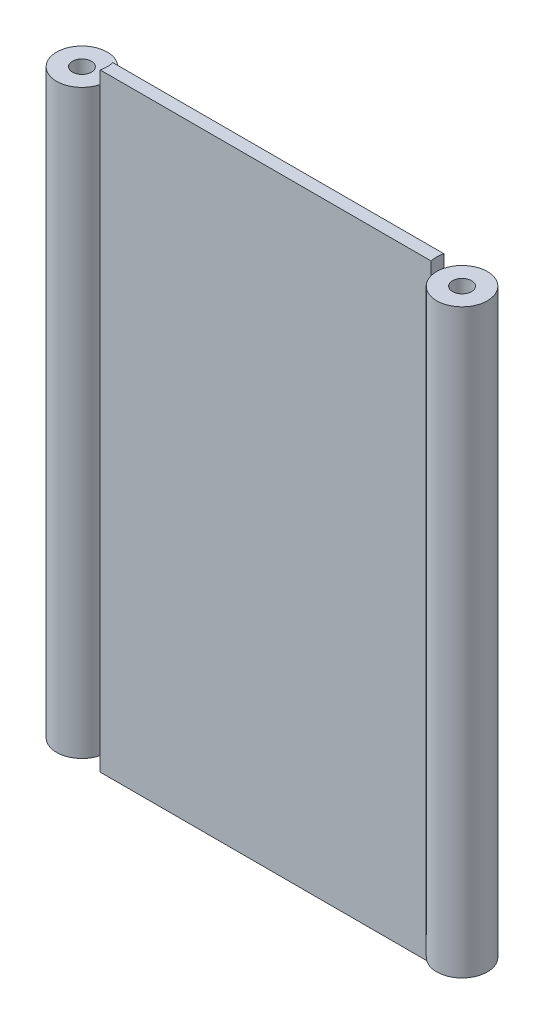
ISO-10303-21;
HEADER;
FILE_DESCRIPTION(('STEP AP214'),'2;1');
FILE_NAME('part.step','',(''),(''),'','','');
FILE_SCHEMA(('AUTOMOTIVE_DESIGN { 1 0 10303 214 1 1 1 1 }'));
ENDSEC;
DATA;
#1=APPLICATION_CONTEXT('core data for automotive mechanical design processes');
#2=APPLICATION_PROTOCOL_DEFINITION('international standard','automotive_design',2000,#1);
#3=PRODUCT_CONTEXT('',#1,'mechanical');
#4=PRODUCT('Part','Part','',(#3));
#5=PRODUCT_RELATED_PRODUCT_CATEGORY('part','',(#4));
#6=PRODUCT_DEFINITION_FORMATION('','',#4);
#7=PRODUCT_DEFINITION_CONTEXT('part definition',#1,'design');
#8=PRODUCT_DEFINITION('design','',#6,#7);
#9=PRODUCT_DEFINITION_SHAPE('','',#8);
#10=(LENGTH_UNIT() NAMED_UNIT(*) SI_UNIT(.MILLI.,.METRE.));
#11=(NAMED_UNIT(*) PLANE_ANGLE_UNIT() SI_UNIT($,.RADIAN.));
#12=(NAMED_UNIT(*) SI_UNIT($,.STERADIAN.) SOLID_ANGLE_UNIT());
#13=UNCERTAINTY_MEASURE_WITH_UNIT(LENGTH_MEASURE(1.E-05),#10,'distance_accuracy_value','');
#14=(GEOMETRIC_REPRESENTATION_CONTEXT(3) GLOBAL_UNCERTAINTY_ASSIGNED_CONTEXT((#13)) GLOBAL_UNIT_ASSIGNED_CONTEXT((#10,
#11,#12)) REPRESENTATION_CONTEXT('',''));
#15=CARTESIAN_POINT('',(0.,0.,0.));
#16=DIRECTION('',(0.,0.,1.));
#17=DIRECTION('',(1.,0.,0.));
#18=AXIS2_PLACEMENT_3D('',#15,#16,#17);
#19=CARTESIAN_POINT('',(47.625,152.4,-1.5875));
#20=DIRECTION('',(0.,-1.,0.));
#21=DIRECTION('',(0.,0.,-1.));
#22=AXIS2_PLACEMENT_3D('',#19,#20,#21);
#23=CYLINDRICAL_SURFACE('',#22,6.35);
#24=DIRECTION('',(0.,-1.,0.));
#25=VECTOR('',#24,1.);
#26=CARTESIAN_POINT('',(41.4766389378957,152.4,-3.175));
#27=LINE('',#26,#25);
#28=CARTESIAN_POINT('',(41.4766389378957,149.225,-3.175));
#29=VERTEX_POINT('',#28);
#30=CARTESIAN_POINT('',(41.4766389378957,3.57187500000006,-3.175));
#31=VERTEX_POINT('',#30);
#32=EDGE_CURVE('E93',#29,#31,#27,.T.);
#33=ORIENTED_EDGE('',*,*,#32,.F.);
#34=CARTESIAN_POINT('',(47.625,149.225,-1.5875));
#35=DIRECTION('',(0.,-1.,0.));
#36=DIRECTION('',(0.,0.,1.));
#37=AXIS2_PLACEMENT_3D('',#34,#35,#36);
#38=CIRCLE('',#37,6.35);
#39=CARTESIAN_POINT('',(41.4766389378957,149.225,0.));
#40=VERTEX_POINT('',#39);
#41=EDGE_CURVE('E144',#29,#40,#38,.T.);
#42=ORIENTED_EDGE('',*,*,#41,.T.);
#43=DIRECTION('',(0.,-1.,0.));
#44=VECTOR('',#43,1.);
#45=CARTESIAN_POINT('',(41.4766389378957,152.4,0.));
#46=LINE('',#45,#44);
#47=CARTESIAN_POINT('',(41.4766389378957,3.571875,0.));
#48=VERTEX_POINT('',#47);
#49=EDGE_CURVE('E159',#40,#48,#46,.T.);
#50=ORIENTED_EDGE('',*,*,#49,.T.);
#51=CARTESIAN_POINT('',(47.625,3.571875,-1.5875));
#52=DIRECTION('',(0.,1.,0.));
#53=DIRECTION('',(0.,0.,-1.));
#54=AXIS2_PLACEMENT_3D('',#51,#52,#53);
#55=CIRCLE('',#54,6.35);
#56=EDGE_CURVE('E172',#48,#31,#55,.T.);
#57=ORIENTED_EDGE('',*,*,#56,.T.);
#58=EDGE_LOOP('',(#33,#42,#50,#57));
#59=FACE_BOUND('',#58,.T.);
#60=ADVANCED_FACE('F68',(#59),#23,.T.);
#61=CARTESIAN_POINT('',(47.625,152.4,-1.5875));
#62=DIRECTION('',(0.,-1.,0.));
#63=DIRECTION('',(0.,0.,-1.));
#64=AXIS2_PLACEMENT_3D('',#61,#62,#63);
#65=CYLINDRICAL_SURFACE('',#64,2.38125);
#66=CARTESIAN_POINT('',(47.625,3.571875,-1.5875));
#67=DIRECTION('',(0.,-1.,0.));
#68=DIRECTION('',(0.,0.,-1.));
#69=AXIS2_PLACEMENT_3D('',#66,#67,#68);
#70=CIRCLE('',#69,2.38125);
#71=CARTESIAN_POINT('',(47.625,3.571875,-3.96875));
#72=VERTEX_POINT('',#71);
#73=EDGE_CURVE('E72',#72,#72,#70,.F.);
#74=ORIENTED_EDGE('',*,*,#73,.F.);
#75=EDGE_LOOP('',(#74));
#76=FACE_BOUND('',#75,.T.);
#77=CARTESIAN_POINT('',(47.625,149.225,-1.5875));
#78=DIRECTION('',(0.,1.,0.));
#79=DIRECTION('',(0.,0.,1.));
#80=AXIS2_PLACEMENT_3D('',#77,#78,#79);
#81=CIRCLE('',#80,2.38125);
#82=CARTESIAN_POINT('',(47.625,149.225,0.793749999999999));
#83=VERTEX_POINT('',#82);
#84=EDGE_CURVE('E178',#83,#83,#81,.F.);
#85=ORIENTED_EDGE('',*,*,#84,.F.);
#86=EDGE_LOOP('',(#85));
#87=FACE_BOUND('',#86,.T.);
#88=ADVANCED_FACE('F199',(#76,#87),#65,.F.);
#89=CARTESIAN_POINT('',(-47.625,152.4,-1.5875));
#90=DIRECTION('',(0.,1.,0.));
#91=DIRECTION('',(0.,0.,1.));
#92=AXIS2_PLACEMENT_3D('',#89,#90,#91);
#93=PLANE('',#92);
#94=DIRECTION('',(1.,0.,0.));
#95=VECTOR('',#94,1.);
#96=CARTESIAN_POINT('',(-41.4766389378957,152.4,0.));
#97=LINE('',#96,#95);
#98=CARTESIAN_POINT('',(-41.4766389378957,152.4,0.));
#99=VERTEX_POINT('',#98);
#100=CARTESIAN_POINT('',(41.4766389378957,152.4,0.));
#101=VERTEX_POINT('',#100);
#102=EDGE_CURVE('E148',#99,#101,#97,.T.);
#103=ORIENTED_EDGE('',*,*,#102,.T.);
#104=CARTESIAN_POINT('',(47.625,152.4,-1.5875));
#105=DIRECTION('',(0.,-1.,0.));
#106=DIRECTION('',(0.,0.,1.));
#107=AXIS2_PLACEMENT_3D('',#104,#105,#106);
#108=CIRCLE('',#107,6.35);
#109=CARTESIAN_POINT('',(41.4766389378957,152.4,-3.175));
#110=VERTEX_POINT('',#109);
#111=EDGE_CURVE('E135',#101,#110,#108,.T.);
#112=ORIENTED_EDGE('',*,*,#111,.T.);
#113=DIRECTION('',(1.,0.,0.));
#114=VECTOR('',#113,1.);
#115=CARTESIAN_POINT('',(-41.4766389378957,152.4,-3.175));
#116=LINE('',#115,#114);
#117=CARTESIAN_POINT('',(-41.4766389378957,152.4,-3.175));
#118=VERTEX_POINT('',#117);
#119=EDGE_CURVE('E152',#118,#110,#116,.T.);
#120=ORIENTED_EDGE('',*,*,#119,.F.);
#121=CARTESIAN_POINT('',(-47.625,152.4,-1.5875));
#122=DIRECTION('',(0.,1.,0.));
#123=DIRECTION('',(0.,0.,1.));
#124=AXIS2_PLACEMENT_3D('',#121,#122,#123);
#125=CIRCLE('',#124,6.35);
#126=EDGE_CURVE('E150',#99,#118,#125,.T.);
#127=ORIENTED_EDGE('',*,*,#126,.F.);
#128=EDGE_LOOP('',(#103,#112,#120,#127));
#129=FACE_BOUND('',#128,.T.);
#130=ADVANCED_FACE('F149',(#129),#93,.T.);
#131=CARTESIAN_POINT('',(-47.625,0.,-1.5875));
#132=DIRECTION('',(0.,1.,0.));
#133=DIRECTION('',(0.,0.,1.));
#134=AXIS2_PLACEMENT_3D('',#131,#132,#133);
#135=PLANE('',#134);
#136=CARTESIAN_POINT('',(47.625,0.,-1.5875));
#137=DIRECTION('',(0.,1.,0.));
#138=DIRECTION('',(0.,0.,-1.));
#139=AXIS2_PLACEMENT_3D('',#136,#137,#138);
#140=CIRCLE('',#139,6.35);
#141=CARTESIAN_POINT('',(41.4766389378957,0.,-3.175));
#142=VERTEX_POINT('',#141);
#143=CARTESIAN_POINT('',(41.4766389378957,0.,0.));
#144=VERTEX_POINT('',#143);
#145=EDGE_CURVE('E176',#142,#144,#140,.T.);
#146=ORIENTED_EDGE('',*,*,#145,.T.);
#147=DIRECTION('',(1.,0.,0.));
#148=VECTOR('',#147,1.);
#149=CARTESIAN_POINT('',(-41.4766389378957,0.,0.));
#150=LINE('',#149,#148);
#151=CARTESIAN_POINT('',(-41.4766389378957,0.,0.));
#152=VERTEX_POINT('',#151);
#153=EDGE_CURVE('E368',#152,#144,#150,.T.);
#154=ORIENTED_EDGE('',*,*,#153,.F.);
#155=CARTESIAN_POINT('',(-47.625,0.,-1.5875));
#156=DIRECTION('',(0.,-1.,0.));
#157=DIRECTION('',(0.,0.,-1.));
#158=AXIS2_PLACEMENT_3D('',#155,#156,#157);
#159=CIRCLE('',#158,6.35);
#160=CARTESIAN_POINT('',(-41.4766389378957,0.,-3.175));
#161=VERTEX_POINT('',#160);
#162=EDGE_CURVE('E375',#161,#152,#159,.T.);
#163=ORIENTED_EDGE('',*,*,#162,.F.);
#164=DIRECTION('',(1.,0.,0.));
#165=VECTOR('',#164,1.);
#166=CARTESIAN_POINT('',(-41.4766389378957,0.,-3.175));
#167=LINE('',#166,#165);
#168=EDGE_CURVE('E153',#161,#142,#167,.T.);
#169=ORIENTED_EDGE('',*,*,#168,.T.);
#170=EDGE_LOOP('',(#146,#154,#163,#169));
#171=FACE_BOUND('',#170,.T.);
#172=ADVANCED_FACE('F232',(#171),#135,.F.);
#173=CARTESIAN_POINT('',(-47.625,152.4,-1.5875));
#174=DIRECTION('',(0.,-1.,0.));
#175=DIRECTION('',(0.,0.,-1.));
#176=AXIS2_PLACEMENT_3D('',#173,#174,#175);
#177=CYLINDRICAL_SURFACE('',#176,6.35);
#178=CARTESIAN_POINT('',(-47.625,149.225,-1.5875));
#179=DIRECTION('',(0.,1.,0.));
#180=DIRECTION('',(0.,0.,1.));
#181=AXIS2_PLACEMENT_3D('',#178,#179,#180);
#182=CIRCLE('',#181,6.35);
#183=CARTESIAN_POINT('',(-41.4766389378957,149.225,-3.175));
#184=VERTEX_POINT('',#183);
#185=CARTESIAN_POINT('',(-41.4766389378957,149.225,0.));
#186=VERTEX_POINT('',#185);
#187=EDGE_CURVE('E344',#184,#186,#182,.T.);
#188=ORIENTED_EDGE('',*,*,#187,.F.);
#189=DIRECTION('',(0.,-1.,0.));
#190=VECTOR('',#189,1.);
#191=CARTESIAN_POINT('',(-41.4766389378957,152.4,-3.175));
#192=LINE('',#191,#190);
#193=CARTESIAN_POINT('',(-41.4766389378957,3.57187500000006,-3.175));
#194=VERTEX_POINT('',#193);
#195=EDGE_CURVE('E347',#184,#194,#192,.T.);
#196=ORIENTED_EDGE('',*,*,#195,.T.);
#197=CARTESIAN_POINT('',(-47.625,3.571875,-1.5875));
#198=DIRECTION('',(0.,-1.,0.));
#199=DIRECTION('',(0.,0.,-1.));
#200=AXIS2_PLACEMENT_3D('',#197,#198,#199);
#201=CIRCLE('',#200,6.35);
#202=CARTESIAN_POINT('',(-41.4766389378957,3.571875,0.));
#203=VERTEX_POINT('',#202);
#204=EDGE_CURVE('E371',#203,#194,#201,.T.);
#205=ORIENTED_EDGE('',*,*,#204,.F.);
#206=DIRECTION('',(0.,-1.,0.));
#207=VECTOR('',#206,1.);
#208=CARTESIAN_POINT('',(-41.4766389378957,152.4,0.));
#209=LINE('',#208,#207);
#210=EDGE_CURVE('E77',#186,#203,#209,.T.);
#211=ORIENTED_EDGE('',*,*,#210,.F.);
#212=EDGE_LOOP('',(#188,#196,#205,#211));
#213=FACE_BOUND('',#212,.T.);
#214=ADVANCED_FACE('F70',(#213),#177,.T.);
#215=CARTESIAN_POINT('',(-47.625,152.4,-1.5875));
#216=DIRECTION('',(0.,-1.,0.));
#217=DIRECTION('',(0.,0.,-1.));
#218=AXIS2_PLACEMENT_3D('',#215,#216,#217);
#219=CYLINDRICAL_SURFACE('',#218,2.38125);
#220=CARTESIAN_POINT('',(-47.625,3.571875,-1.5875));
#221=DIRECTION('',(0.,-1.,0.));
#222=DIRECTION('',(0.,0.,-1.));
#223=AXIS2_PLACEMENT_3D('',#220,#221,#222);
#224=CIRCLE('',#223,2.38125);
#225=CARTESIAN_POINT('',(-47.625,3.571875,-3.96875));
#226=VERTEX_POINT('',#225);
#227=EDGE_CURVE('E362',#226,#226,#224,.T.);
#228=ORIENTED_EDGE('',*,*,#227,.T.);
#229=EDGE_LOOP('',(#228));
#230=FACE_BOUND('',#229,.T.);
#231=CARTESIAN_POINT('',(-47.625,149.225,-1.5875));
#232=DIRECTION('',(0.,1.,0.));
#233=DIRECTION('',(0.,0.,1.));
#234=AXIS2_PLACEMENT_3D('',#231,#232,#233);
#235=CIRCLE('',#234,2.38125);
#236=CARTESIAN_POINT('',(-47.625,149.225,0.793749999999999));
#237=VERTEX_POINT('',#236);
#238=EDGE_CURVE('E378',#237,#237,#235,.T.);
#239=ORIENTED_EDGE('',*,*,#238,.T.);
#240=EDGE_LOOP('',(#239));
#241=FACE_BOUND('',#240,.T.);
#242=ADVANCED_FACE('F226',(#230,#241),#219,.F.);
#243=CARTESIAN_POINT('',(-41.4766389378957,152.4,0.));
#244=DIRECTION('',(0.,0.,-1.));
#245=DIRECTION('',(-1.,0.,0.));
#246=AXIS2_PLACEMENT_3D('',#243,#244,#245);
#247=PLANE('',#246);
#248=ORIENTED_EDGE('',*,*,#153,.T.);
#249=EDGE_CURVE('E162',#48,#144,#46,.T.);
#250=ORIENTED_EDGE('',*,*,#249,.F.);
#251=ORIENTED_EDGE('',*,*,#49,.F.);
#252=EDGE_CURVE('E139',#101,#40,#46,.T.);
#253=ORIENTED_EDGE('',*,*,#252,.F.);
#254=ORIENTED_EDGE('',*,*,#102,.F.);
#255=EDGE_CURVE('E12',#99,#186,#209,.T.);
#256=ORIENTED_EDGE('',*,*,#255,.T.);
#257=ORIENTED_EDGE('',*,*,#210,.T.);
#258=DIRECTION('',(0.,-1.,0.));
#259=VECTOR('',#258,1.);
#260=CARTESIAN_POINT('',(-41.4766389378957,3.571875,0.));
#261=LINE('',#260,#259);
#262=EDGE_CURVE('E364',#203,#152,#261,.T.);
#263=ORIENTED_EDGE('',*,*,#262,.T.);
#264=EDGE_LOOP('',(#248,#250,#251,#253,#254,#256,#257,#263));
#265=FACE_BOUND('',#264,.T.);
#266=ADVANCED_FACE('F157',(#265),#247,.F.);
#267=CARTESIAN_POINT('',(-41.4766389378957,152.4,-3.175));
#268=DIRECTION('',(0.,0.,-1.));
#269=DIRECTION('',(-1.,0.,0.));
#270=AXIS2_PLACEMENT_3D('',#267,#268,#269);
#271=PLANE('',#270);
#272=ORIENTED_EDGE('',*,*,#168,.F.);
#273=EDGE_CURVE('E358',#194,#161,#192,.T.);
#274=ORIENTED_EDGE('',*,*,#273,.F.);
#275=ORIENTED_EDGE('',*,*,#195,.F.);
#276=EDGE_CURVE('E357',#118,#184,#192,.T.);
#277=ORIENTED_EDGE('',*,*,#276,.F.);
#278=ORIENTED_EDGE('',*,*,#119,.T.);
#279=EDGE_CURVE('E140',#110,#29,#27,.T.);
#280=ORIENTED_EDGE('',*,*,#279,.T.);
#281=ORIENTED_EDGE('',*,*,#32,.T.);
#282=EDGE_CURVE('E160',#31,#142,#27,.T.);
#283=ORIENTED_EDGE('',*,*,#282,.T.);
#284=EDGE_LOOP('',(#272,#274,#275,#277,#278,#280,#281,#283));
#285=FACE_BOUND('',#284,.T.);
#286=ADVANCED_FACE('F224',(#285),#271,.T.);
#287=CARTESIAN_POINT('',(-47.625,3.571875,-1.5875));
#288=DIRECTION('',(0.,-1.,0.));
#289=DIRECTION('',(0.,0.,-1.));
#290=AXIS2_PLACEMENT_3D('',#287,#288,#289);
#291=CYLINDRICAL_SURFACE('',#290,6.35);
#292=EDGE_CURVE('E365',#194,#203,#201,.T.);
#293=ORIENTED_EDGE('',*,*,#292,.F.);
#294=ORIENTED_EDGE('',*,*,#273,.T.);
#295=ORIENTED_EDGE('',*,*,#162,.T.);
#296=ORIENTED_EDGE('',*,*,#262,.F.);
#297=EDGE_LOOP('',(#293,#294,#295,#296));
#298=FACE_BOUND('',#297,.T.);
#299=ADVANCED_FACE('F220',(#298),#291,.F.);
#300=CARTESIAN_POINT('',(-47.625,3.571875,-1.5875));
#301=DIRECTION('',(0.,-1.,0.));
#302=DIRECTION('',(0.,0.,-1.));
#303=AXIS2_PLACEMENT_3D('',#300,#301,#302);
#304=PLANE('',#303);
#305=ORIENTED_EDGE('',*,*,#227,.F.);
#306=EDGE_LOOP('',(#305));
#307=FACE_BOUND('',#306,.T.);
#308=ORIENTED_EDGE('',*,*,#292,.T.);
#309=ORIENTED_EDGE('',*,*,#204,.T.);
#310=EDGE_LOOP('',(#308,#309));
#311=FACE_BOUND('',#310,.T.);
#312=ADVANCED_FACE('F216',(#307,#311),#304,.T.);
#313=CARTESIAN_POINT('',(-47.625,149.225,-1.5875));
#314=DIRECTION('',(0.,1.,0.));
#315=DIRECTION('',(0.,0.,1.));
#316=AXIS2_PLACEMENT_3D('',#313,#314,#315);
#317=CYLINDRICAL_SURFACE('',#316,6.35);
#318=ORIENTED_EDGE('',*,*,#126,.T.);
#319=ORIENTED_EDGE('',*,*,#276,.T.);
#320=EDGE_CURVE('E352',#186,#184,#182,.T.);
#321=ORIENTED_EDGE('',*,*,#320,.F.);
#322=ORIENTED_EDGE('',*,*,#255,.F.);
#323=EDGE_LOOP('',(#318,#319,#321,#322));
#324=FACE_BOUND('',#323,.T.);
#325=ADVANCED_FACE('F212',(#324),#317,.F.);
#326=CARTESIAN_POINT('',(-47.625,149.225,-1.5875));
#327=DIRECTION('',(0.,1.,0.));
#328=DIRECTION('',(0.,0.,1.));
#329=AXIS2_PLACEMENT_3D('',#326,#327,#328);
#330=PLANE('',#329);
#331=ORIENTED_EDGE('',*,*,#238,.F.);
#332=EDGE_LOOP('',(#331));
#333=FACE_BOUND('',#332,.T.);
#334=ORIENTED_EDGE('',*,*,#320,.T.);
#335=ORIENTED_EDGE('',*,*,#187,.T.);
#336=EDGE_LOOP('',(#334,#335));
#337=FACE_BOUND('',#336,.T.);
#338=ADVANCED_FACE('F208',(#333,#337),#330,.T.);
#339=CARTESIAN_POINT('',(47.625,3.571875,-1.5875));
#340=DIRECTION('',(0.,-1.,0.));
#341=DIRECTION('',(0.,0.,-1.));
#342=AXIS2_PLACEMENT_3D('',#339,#340,#341);
#343=CYLINDRICAL_SURFACE('',#342,6.35);
#344=ORIENTED_EDGE('',*,*,#249,.T.);
#345=ORIENTED_EDGE('',*,*,#145,.F.);
#346=ORIENTED_EDGE('',*,*,#282,.F.);
#347=EDGE_CURVE('E169',#31,#48,#55,.T.);
#348=ORIENTED_EDGE('',*,*,#347,.T.);
#349=EDGE_LOOP('',(#344,#345,#346,#348));
#350=FACE_BOUND('',#349,.T.);
#351=ADVANCED_FACE('F211',(#350),#343,.F.);
#352=CARTESIAN_POINT('',(47.625,3.571875,-1.5875));
#353=DIRECTION('',(0.,-1.,0.));
#354=DIRECTION('',(0.,0.,-1.));
#355=AXIS2_PLACEMENT_3D('',#352,#353,#354);
#356=PLANE('',#355);
#357=ORIENTED_EDGE('',*,*,#347,.F.);
#358=ORIENTED_EDGE('',*,*,#56,.F.);
#359=EDGE_LOOP('',(#357,#358));
#360=FACE_BOUND('',#359,.T.);
#361=ORIENTED_EDGE('',*,*,#73,.T.);
#362=EDGE_LOOP('',(#361));
#363=FACE_BOUND('',#362,.T.);
#364=ADVANCED_FACE('F196',(#360,#363),#356,.T.);
#365=CARTESIAN_POINT('',(47.625,149.225,-1.5875));
#366=DIRECTION('',(0.,1.,0.));
#367=DIRECTION('',(0.,0.,1.));
#368=AXIS2_PLACEMENT_3D('',#365,#366,#367);
#369=CYLINDRICAL_SURFACE('',#368,6.35);
#370=ORIENTED_EDGE('',*,*,#252,.T.);
#371=EDGE_CURVE('E85',#40,#29,#38,.T.);
#372=ORIENTED_EDGE('',*,*,#371,.T.);
#373=ORIENTED_EDGE('',*,*,#279,.F.);
#374=ORIENTED_EDGE('',*,*,#111,.F.);
#375=EDGE_LOOP('',(#370,#372,#373,#374));
#376=FACE_BOUND('',#375,.T.);
#377=ADVANCED_FACE('F137',(#376),#369,.F.);
#378=CARTESIAN_POINT('',(47.625,149.225,-1.5875));
#379=DIRECTION('',(0.,1.,0.));
#380=DIRECTION('',(0.,0.,1.));
#381=AXIS2_PLACEMENT_3D('',#378,#379,#380);
#382=PLANE('',#381);
#383=ORIENTED_EDGE('',*,*,#371,.F.);
#384=ORIENTED_EDGE('',*,*,#41,.F.);
#385=EDGE_LOOP('',(#383,#384));
#386=FACE_BOUND('',#385,.T.);
#387=ORIENTED_EDGE('',*,*,#84,.T.);
#388=EDGE_LOOP('',(#387));
#389=FACE_BOUND('',#388,.T.);
#390=ADVANCED_FACE('F190',(#386,#389),#382,.T.);
#391=CLOSED_SHELL('',(#60,#88,#130,#172,#214,#242,#266,#286,#299,#312,#325,#338,#351,#364,#377,#390));
#392=MANIFOLD_SOLID_BREP('B2',#391);
#393=ADVANCED_BREP_SHAPE_REPRESENTATION('',(#18,#392),#14);
#394=SHAPE_DEFINITION_REPRESENTATION(#9,#393);
ENDSEC;
END-ISO-10303-21;
